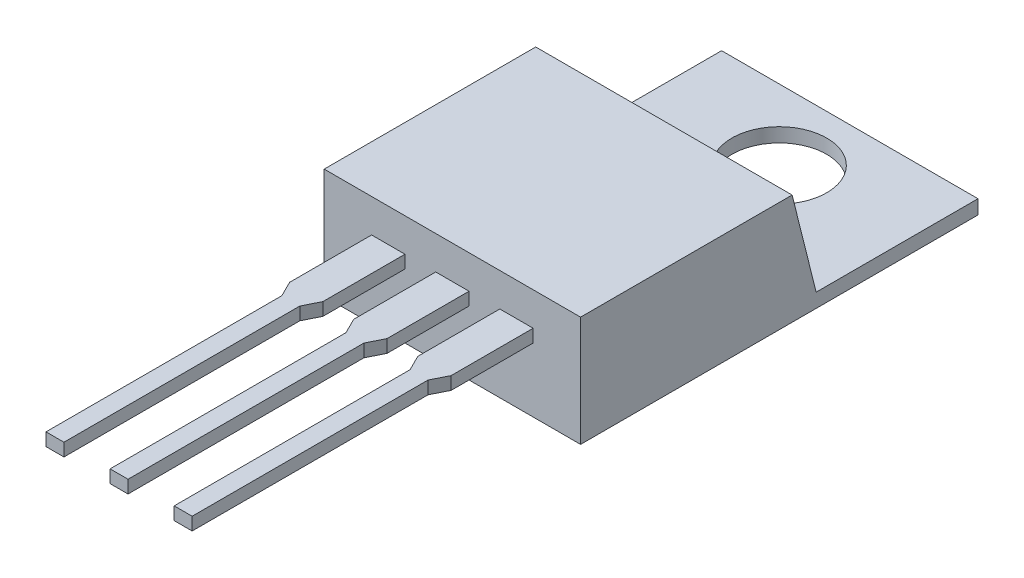
ISO-10303-21;
HEADER;
FILE_DESCRIPTION(('STEP AP214'),'2;1');
FILE_NAME('part.step','',(''),(''),'','','');
FILE_SCHEMA(('AUTOMOTIVE_DESIGN { 1 0 10303 214 1 1 1 1 }'));
ENDSEC;
DATA;
#1=APPLICATION_CONTEXT('core data for automotive mechanical design processes');
#2=APPLICATION_PROTOCOL_DEFINITION('international standard','automotive_design',2000,#1);
#3=PRODUCT_CONTEXT('',#1,'mechanical');
#4=PRODUCT('Part','Part','',(#3));
#5=PRODUCT_RELATED_PRODUCT_CATEGORY('part','',(#4));
#6=PRODUCT_DEFINITION_FORMATION('','',#4);
#7=PRODUCT_DEFINITION_CONTEXT('part definition',#1,'design');
#8=PRODUCT_DEFINITION('design','',#6,#7);
#9=PRODUCT_DEFINITION_SHAPE('','',#8);
#10=(LENGTH_UNIT() NAMED_UNIT(*) SI_UNIT(.MILLI.,.METRE.));
#11=(NAMED_UNIT(*) PLANE_ANGLE_UNIT() SI_UNIT($,.RADIAN.));
#12=(NAMED_UNIT(*) SI_UNIT($,.STERADIAN.) SOLID_ANGLE_UNIT());
#13=UNCERTAINTY_MEASURE_WITH_UNIT(LENGTH_MEASURE(1.E-05),#10,'distance_accuracy_value','');
#14=(GEOMETRIC_REPRESENTATION_CONTEXT(3) GLOBAL_UNCERTAINTY_ASSIGNED_CONTEXT((#13)) GLOBAL_UNIT_ASSIGNED_CONTEXT((#10,
#11,#12)) REPRESENTATION_CONTEXT('',''));
#15=CARTESIAN_POINT('',(0.,0.,0.));
#16=DIRECTION('',(0.,0.,1.));
#17=DIRECTION('',(1.,0.,0.));
#18=AXIS2_PLACEMENT_3D('',#15,#16,#17);
#19=CARTESIAN_POINT('',(0.,0.55,0.));
#20=DIRECTION('',(0.,0.,-1.));
#21=DIRECTION('',(-1.,0.,0.));
#22=AXIS2_PLACEMENT_3D('',#19,#20,#21);
#23=PLANE('',#22);
#24=DIRECTION('',(0.,-1.,0.));
#25=VECTOR('',#24,1.);
#26=CARTESIAN_POINT('',(4.35,3.,0.));
#27=LINE('',#26,#25);
#28=CARTESIAN_POINT('',(4.35,3.,0.));
#29=VERTEX_POINT('',#28);
#30=CARTESIAN_POINT('',(4.35,2.5,0.));
#31=VERTEX_POINT('',#30);
#32=EDGE_CURVE('E266',#29,#31,#27,.T.);
#33=ORIENTED_EDGE('',*,*,#32,.F.);
#34=DIRECTION('',(-1.,0.,0.));
#35=VECTOR('',#34,1.);
#36=CARTESIAN_POINT('',(4.35,3.,0.));
#37=LINE('',#36,#35);
#38=CARTESIAN_POINT('',(5.65,3.,0.));
#39=VERTEX_POINT('',#38);
#40=EDGE_CURVE('E394',#39,#29,#37,.T.);
#41=ORIENTED_EDGE('',*,*,#40,.F.);
#42=DIRECTION('',(0.,1.,0.));
#43=VECTOR('',#42,1.);
#44=CARTESIAN_POINT('',(5.65,3.,0.));
#45=LINE('',#44,#43);
#46=CARTESIAN_POINT('',(5.65,2.5,0.));
#47=VERTEX_POINT('',#46);
#48=EDGE_CURVE('E397',#47,#39,#45,.T.);
#49=ORIENTED_EDGE('',*,*,#48,.F.);
#50=DIRECTION('',(1.,0.,0.));
#51=VECTOR('',#50,1.);
#52=CARTESIAN_POINT('',(4.35,2.5,0.));
#53=LINE('',#52,#51);
#54=EDGE_CURVE('E401',#31,#47,#53,.T.);
#55=ORIENTED_EDGE('',*,*,#54,.F.);
#56=EDGE_LOOP('',(#33,#41,#49,#55));
#57=FACE_BOUND('',#56,.T.);
#58=DIRECTION('',(1.,0.,0.));
#59=VECTOR('',#58,1.);
#60=CARTESIAN_POINT('',(0.,0.,0.));
#61=LINE('',#60,#59);
#62=CARTESIAN_POINT('',(0.,0.,0.));
#63=VERTEX_POINT('',#62);
#64=CARTESIAN_POINT('',(10.,0.,0.));
#65=VERTEX_POINT('',#64);
#66=EDGE_CURVE('E304',#63,#65,#61,.T.);
#67=ORIENTED_EDGE('',*,*,#66,.T.);
#68=DIRECTION('',(0.,-1.,0.));
#69=VECTOR('',#68,1.);
#70=CARTESIAN_POINT('',(10.,0.55,0.));
#71=LINE('',#70,#69);
#72=CARTESIAN_POINT('',(10.,4.3,0.));
#73=VERTEX_POINT('',#72);
#74=EDGE_CURVE('E314',#73,#65,#71,.T.);
#75=ORIENTED_EDGE('',*,*,#74,.F.);
#76=DIRECTION('',(1.,0.,0.));
#77=VECTOR('',#76,1.);
#78=CARTESIAN_POINT('',(0.,4.3,0.));
#79=LINE('',#78,#77);
#80=CARTESIAN_POINT('',(0.,4.3,0.));
#81=VERTEX_POINT('',#80);
#82=EDGE_CURVE('E281',#81,#73,#79,.T.);
#83=ORIENTED_EDGE('',*,*,#82,.F.);
#84=DIRECTION('',(0.,-1.,0.));
#85=VECTOR('',#84,1.);
#86=CARTESIAN_POINT('',(0.,0.55,0.));
#87=LINE('',#86,#85);
#88=EDGE_CURVE('E317',#81,#63,#87,.T.);
#89=ORIENTED_EDGE('',*,*,#88,.T.);
#90=EDGE_LOOP('',(#67,#75,#83,#89));
#91=FACE_BOUND('',#90,.T.);
#92=DIRECTION('',(0.,-1.,0.));
#93=VECTOR('',#92,1.);
#94=CARTESIAN_POINT('',(1.85,3.,0.));
#95=LINE('',#94,#93);
#96=CARTESIAN_POINT('',(1.85,3.,0.));
#97=VERTEX_POINT('',#96);
#98=CARTESIAN_POINT('',(1.85,2.5,0.));
#99=VERTEX_POINT('',#98);
#100=EDGE_CURVE('E262',#97,#99,#95,.T.);
#101=ORIENTED_EDGE('',*,*,#100,.F.);
#102=DIRECTION('',(-1.,0.,0.));
#103=VECTOR('',#102,1.);
#104=CARTESIAN_POINT('',(1.85,3.,0.));
#105=LINE('',#104,#103);
#106=CARTESIAN_POINT('',(3.15,3.,0.));
#107=VERTEX_POINT('',#106);
#108=EDGE_CURVE('E258',#107,#97,#105,.T.);
#109=ORIENTED_EDGE('',*,*,#108,.F.);
#110=DIRECTION('',(0.,1.,0.));
#111=VECTOR('',#110,1.);
#112=CARTESIAN_POINT('',(3.15,3.,0.));
#113=LINE('',#112,#111);
#114=CARTESIAN_POINT('',(3.15,2.5,0.));
#115=VERTEX_POINT('',#114);
#116=EDGE_CURVE('E269',#115,#107,#113,.T.);
#117=ORIENTED_EDGE('',*,*,#116,.F.);
#118=DIRECTION('',(1.,0.,0.));
#119=VECTOR('',#118,1.);
#120=CARTESIAN_POINT('',(1.85,2.5,0.));
#121=LINE('',#120,#119);
#122=EDGE_CURVE('E265',#99,#115,#121,.T.);
#123=ORIENTED_EDGE('',*,*,#122,.F.);
#124=EDGE_LOOP('',(#101,#109,#117,#123));
#125=FACE_BOUND('',#124,.T.);
#126=DIRECTION('',(0.,-1.,0.));
#127=VECTOR('',#126,1.);
#128=CARTESIAN_POINT('',(6.85,3.,0.));
#129=LINE('',#128,#127);
#130=CARTESIAN_POINT('',(6.85,3.,0.));
#131=VERTEX_POINT('',#130);
#132=CARTESIAN_POINT('',(6.85,2.5,0.));
#133=VERTEX_POINT('',#132);
#134=EDGE_CURVE('E378',#131,#133,#129,.T.);
#135=ORIENTED_EDGE('',*,*,#134,.F.);
#136=DIRECTION('',(-1.,0.,0.));
#137=VECTOR('',#136,1.);
#138=CARTESIAN_POINT('',(6.85,3.,0.));
#139=LINE('',#138,#137);
#140=CARTESIAN_POINT('',(8.15,3.,0.));
#141=VERTEX_POINT('',#140);
#142=EDGE_CURVE('E368',#141,#131,#139,.T.);
#143=ORIENTED_EDGE('',*,*,#142,.F.);
#144=DIRECTION('',(0.,1.,0.));
#145=VECTOR('',#144,1.);
#146=CARTESIAN_POINT('',(8.15,3.,0.));
#147=LINE('',#146,#145);
#148=CARTESIAN_POINT('',(8.15,2.5,0.));
#149=VERTEX_POINT('',#148);
#150=EDGE_CURVE('E371',#149,#141,#147,.T.);
#151=ORIENTED_EDGE('',*,*,#150,.F.);
#152=DIRECTION('',(1.,0.,0.));
#153=VECTOR('',#152,1.);
#154=CARTESIAN_POINT('',(6.85,2.5,0.));
#155=LINE('',#154,#153);
#156=EDGE_CURVE('E375',#133,#149,#155,.T.);
#157=ORIENTED_EDGE('',*,*,#156,.F.);
#158=EDGE_LOOP('',(#135,#143,#151,#157));
#159=FACE_BOUND('',#158,.T.);
#160=ADVANCED_FACE('F40',(#57,#91,#125,#159),#23,.F.);
#161=CARTESIAN_POINT('',(0.,0.55,0.));
#162=DIRECTION('',(0.,-1.,0.));
#163=DIRECTION('',(0.,0.,-1.));
#164=AXIS2_PLACEMENT_3D('',#161,#162,#163);
#165=PLANE('',#164);
#166=CARTESIAN_POINT('',(5.,0.55,-12.75));
#167=DIRECTION('',(0.,1.,0.));
#168=DIRECTION('',(0.,0.,1.));
#169=AXIS2_PLACEMENT_3D('',#166,#167,#168);
#170=CIRCLE('',#169,1.85);
#171=CARTESIAN_POINT('',(5.,0.55,-10.9));
#172=VERTEX_POINT('',#171);
#173=EDGE_CURVE('E288',#172,#172,#170,.T.);
#174=ORIENTED_EDGE('',*,*,#173,.F.);
#175=EDGE_LOOP('',(#174));
#176=FACE_BOUND('',#175,.T.);
#177=DIRECTION('',(0.,0.,1.));
#178=VECTOR('',#177,1.);
#179=CARTESIAN_POINT('',(0.,0.55,0.));
#180=LINE('',#179,#178);
#181=CARTESIAN_POINT('',(0.,0.55,-15.5));
#182=VERTEX_POINT('',#181);
#183=CARTESIAN_POINT('',(0.,0.55,-9.1875));
#184=VERTEX_POINT('',#183);
#185=EDGE_CURVE('E294',#182,#184,#180,.T.);
#186=ORIENTED_EDGE('',*,*,#185,.T.);
#187=DIRECTION('',(-1.,0.,0.));
#188=VECTOR('',#187,1.);
#189=CARTESIAN_POINT('',(0.,0.55,-9.1875));
#190=LINE('',#189,#188);
#191=CARTESIAN_POINT('',(10.,0.55,-9.1875));
#192=VERTEX_POINT('',#191);
#193=EDGE_CURVE('E328',#184,#192,#190,.F.);
#194=ORIENTED_EDGE('',*,*,#193,.T.);
#195=DIRECTION('',(0.,0.,-1.));
#196=VECTOR('',#195,1.);
#197=CARTESIAN_POINT('',(10.,0.55,0.));
#198=LINE('',#197,#196);
#199=CARTESIAN_POINT('',(10.,0.55,-15.5));
#200=VERTEX_POINT('',#199);
#201=EDGE_CURVE('E296',#192,#200,#198,.T.);
#202=ORIENTED_EDGE('',*,*,#201,.T.);
#203=DIRECTION('',(-1.,0.,0.));
#204=VECTOR('',#203,1.);
#205=CARTESIAN_POINT('',(0.,0.55,-15.5));
#206=LINE('',#205,#204);
#207=EDGE_CURVE('E299',#200,#182,#206,.T.);
#208=ORIENTED_EDGE('',*,*,#207,.T.);
#209=EDGE_LOOP('',(#186,#194,#202,#208));
#210=FACE_BOUND('',#209,.T.);
#211=ADVANCED_FACE('F518',(#176,#210),#165,.F.);
#212=CARTESIAN_POINT('',(0.,0.,0.));
#213=DIRECTION('',(0.,-1.,0.));
#214=DIRECTION('',(0.,0.,-1.));
#215=AXIS2_PLACEMENT_3D('',#212,#213,#214);
#216=PLANE('',#215);
#217=DIRECTION('',(0.,0.,1.));
#218=VECTOR('',#217,1.);
#219=CARTESIAN_POINT('',(0.,0.,0.));
#220=LINE('',#219,#218);
#221=CARTESIAN_POINT('',(0.,0.,-15.5));
#222=VERTEX_POINT('',#221);
#223=EDGE_CURVE('E291',#222,#63,#220,.T.);
#224=ORIENTED_EDGE('',*,*,#223,.F.);
#225=DIRECTION('',(-1.,0.,0.));
#226=VECTOR('',#225,1.);
#227=CARTESIAN_POINT('',(0.,0.,-15.5));
#228=LINE('',#227,#226);
#229=CARTESIAN_POINT('',(10.,0.,-15.5));
#230=VERTEX_POINT('',#229);
#231=EDGE_CURVE('E297',#230,#222,#228,.T.);
#232=ORIENTED_EDGE('',*,*,#231,.F.);
#233=DIRECTION('',(0.,0.,-1.));
#234=VECTOR('',#233,1.);
#235=CARTESIAN_POINT('',(10.,0.,0.));
#236=LINE('',#235,#234);
#237=EDGE_CURVE('E306',#65,#230,#236,.T.);
#238=ORIENTED_EDGE('',*,*,#237,.F.);
#239=ORIENTED_EDGE('',*,*,#66,.F.);
#240=EDGE_LOOP('',(#224,#232,#238,#239));
#241=FACE_BOUND('',#240,.T.);
#242=CARTESIAN_POINT('',(5.,0.,-12.75));
#243=DIRECTION('',(0.,1.,0.));
#244=DIRECTION('',(0.,0.,1.));
#245=AXIS2_PLACEMENT_3D('',#242,#243,#244);
#246=CIRCLE('',#245,1.85);
#247=CARTESIAN_POINT('',(5.,0.,-10.9));
#248=VERTEX_POINT('',#247);
#249=EDGE_CURVE('E287',#248,#248,#246,.T.);
#250=ORIENTED_EDGE('',*,*,#249,.T.);
#251=EDGE_LOOP('',(#250));
#252=FACE_BOUND('',#251,.T.);
#253=ADVANCED_FACE('F524',(#241,#252),#216,.T.);
#254=CARTESIAN_POINT('',(0.,0.55,0.));
#255=DIRECTION('',(1.,0.,0.));
#256=DIRECTION('',(0.,0.,-1.));
#257=AXIS2_PLACEMENT_3D('',#254,#255,#256);
#258=PLANE('',#257);
#259=DIRECTION('',(0.,0.97014250014533,0.242535625036339));
#260=VECTOR('',#259,1.);
#261=CARTESIAN_POINT('',(0.,4.3,-8.24999999999997));
#262=LINE('',#261,#260);
#263=CARTESIAN_POINT('',(0.,4.3,-8.24999999999997));
#264=VERTEX_POINT('',#263);
#265=EDGE_CURVE('E323',#264,#184,#262,.F.);
#266=ORIENTED_EDGE('',*,*,#265,.T.);
#267=ORIENTED_EDGE('',*,*,#185,.F.);
#268=DIRECTION('',(0.,-1.,0.));
#269=VECTOR('',#268,1.);
#270=CARTESIAN_POINT('',(0.,0.55,-15.5));
#271=LINE('',#270,#269);
#272=EDGE_CURVE('E301',#182,#222,#271,.T.);
#273=ORIENTED_EDGE('',*,*,#272,.T.);
#274=ORIENTED_EDGE('',*,*,#223,.T.);
#275=ORIENTED_EDGE('',*,*,#88,.F.);
#276=DIRECTION('',(0.,0.,1.));
#277=VECTOR('',#276,1.);
#278=CARTESIAN_POINT('',(0.,4.3,0.));
#279=LINE('',#278,#277);
#280=EDGE_CURVE('E279',#264,#81,#279,.T.);
#281=ORIENTED_EDGE('',*,*,#280,.F.);
#282=EDGE_LOOP('',(#266,#267,#273,#274,#275,#281));
#283=FACE_BOUND('',#282,.T.);
#284=ADVANCED_FACE('F532',(#283),#258,.F.);
#285=CARTESIAN_POINT('',(10.,0.55,0.));
#286=DIRECTION('',(-1.,0.,0.));
#287=DIRECTION('',(0.,0.,1.));
#288=AXIS2_PLACEMENT_3D('',#285,#286,#287);
#289=PLANE('',#288);
#290=ORIENTED_EDGE('',*,*,#201,.F.);
#291=DIRECTION('',(0.,-0.97014250014533,-0.242535625036339));
#292=VECTOR('',#291,1.);
#293=CARTESIAN_POINT('',(10.,4.3,-8.24999999999997));
#294=LINE('',#293,#292);
#295=CARTESIAN_POINT('',(10.,4.3,-8.24999999999997));
#296=VERTEX_POINT('',#295);
#297=EDGE_CURVE('E326',#192,#296,#294,.F.);
#298=ORIENTED_EDGE('',*,*,#297,.T.);
#299=DIRECTION('',(0.,0.,-1.));
#300=VECTOR('',#299,1.);
#301=CARTESIAN_POINT('',(10.,4.3,0.));
#302=LINE('',#301,#300);
#303=EDGE_CURVE('E284',#73,#296,#302,.T.);
#304=ORIENTED_EDGE('',*,*,#303,.F.);
#305=ORIENTED_EDGE('',*,*,#74,.T.);
#306=ORIENTED_EDGE('',*,*,#237,.T.);
#307=DIRECTION('',(0.,-1.,0.));
#308=VECTOR('',#307,1.);
#309=CARTESIAN_POINT('',(10.,0.55,-15.5));
#310=LINE('',#309,#308);
#311=EDGE_CURVE('E311',#200,#230,#310,.T.);
#312=ORIENTED_EDGE('',*,*,#311,.F.);
#313=EDGE_LOOP('',(#290,#298,#304,#305,#306,#312));
#314=FACE_BOUND('',#313,.T.);
#315=ADVANCED_FACE('F530',(#314),#289,.F.);
#316=CARTESIAN_POINT('',(0.,0.55,-15.5));
#317=DIRECTION('',(0.,0.,1.));
#318=DIRECTION('',(1.,0.,0.));
#319=AXIS2_PLACEMENT_3D('',#316,#317,#318);
#320=PLANE('',#319);
#321=ORIENTED_EDGE('',*,*,#231,.T.);
#322=ORIENTED_EDGE('',*,*,#272,.F.);
#323=ORIENTED_EDGE('',*,*,#207,.F.);
#324=ORIENTED_EDGE('',*,*,#311,.T.);
#325=EDGE_LOOP('',(#321,#322,#323,#324));
#326=FACE_BOUND('',#325,.T.);
#327=ADVANCED_FACE('F539',(#326),#320,.F.);
#328=CARTESIAN_POINT('',(5.,0.55,-12.75));
#329=DIRECTION('',(0.,-1.,0.));
#330=DIRECTION('',(0.,0.,-1.));
#331=AXIS2_PLACEMENT_3D('',#328,#329,#330);
#332=CYLINDRICAL_SURFACE('',#331,1.85);
#333=ORIENTED_EDGE('',*,*,#173,.T.);
#334=EDGE_LOOP('',(#333));
#335=FACE_BOUND('',#334,.T.);
#336=ORIENTED_EDGE('',*,*,#249,.F.);
#337=EDGE_LOOP('',(#336));
#338=FACE_BOUND('',#337,.T.);
#339=ADVANCED_FACE('F564',(#335,#338),#332,.F.);
#340=CARTESIAN_POINT('',(0.,4.3,0.));
#341=DIRECTION('',(0.,-1.,0.));
#342=DIRECTION('',(0.,0.,-1.));
#343=AXIS2_PLACEMENT_3D('',#340,#341,#342);
#344=PLANE('',#343);
#345=ORIENTED_EDGE('',*,*,#303,.T.);
#346=DIRECTION('',(-1.,0.,0.));
#347=VECTOR('',#346,1.);
#348=CARTESIAN_POINT('',(0.,4.3,-8.24999999999997));
#349=LINE('',#348,#347);
#350=EDGE_CURVE('E320',#296,#264,#349,.T.);
#351=ORIENTED_EDGE('',*,*,#350,.T.);
#352=ORIENTED_EDGE('',*,*,#280,.T.);
#353=ORIENTED_EDGE('',*,*,#82,.T.);
#354=EDGE_LOOP('',(#345,#351,#352,#353));
#355=FACE_BOUND('',#354,.T.);
#356=ADVANCED_FACE('F562',(#355),#344,.F.);
#357=CARTESIAN_POINT('',(0.,4.3,-8.24999999999997));
#358=DIRECTION('',(0.,-0.242535625036339,0.97014250014533));
#359=DIRECTION('',(-1.,0.,0.));
#360=AXIS2_PLACEMENT_3D('',#357,#358,#359);
#361=PLANE('',#360);
#362=ORIENTED_EDGE('',*,*,#297,.F.);
#363=ORIENTED_EDGE('',*,*,#193,.F.);
#364=ORIENTED_EDGE('',*,*,#265,.F.);
#365=ORIENTED_EDGE('',*,*,#350,.F.);
#366=EDGE_LOOP('',(#362,#363,#364,#365));
#367=FACE_BOUND('',#366,.T.);
#368=ADVANCED_FACE('F43',(#367),#361,.F.);
#369=CARTESIAN_POINT('',(1.85,3.,13.));
#370=DIRECTION('',(1.,0.,0.));
#371=DIRECTION('',(0.,1.,0.));
#372=AXIS2_PLACEMENT_3D('',#369,#370,#371);
#373=PLANE('',#372);
#374=DIRECTION('',(0.,0.,-1.));
#375=VECTOR('',#374,1.);
#376=CARTESIAN_POINT('',(1.85,2.5,13.));
#377=LINE('',#376,#375);
#378=CARTESIAN_POINT('',(1.85,2.5,3.2));
#379=VERTEX_POINT('',#378);
#380=EDGE_CURVE('E277',#379,#99,#377,.T.);
#381=ORIENTED_EDGE('',*,*,#380,.F.);
#382=DIRECTION('',(0.,1.,0.));
#383=VECTOR('',#382,1.);
#384=CARTESIAN_POINT('',(1.85,0.,3.2));
#385=LINE('',#384,#383);
#386=CARTESIAN_POINT('',(1.85,3.,3.2));
#387=VERTEX_POINT('',#386);
#388=EDGE_CURVE('E439',#379,#387,#385,.T.);
#389=ORIENTED_EDGE('',*,*,#388,.T.);
#390=DIRECTION('',(0.,0.,-1.));
#391=VECTOR('',#390,1.);
#392=CARTESIAN_POINT('',(1.85,3.,13.));
#393=LINE('',#392,#391);
#394=EDGE_CURVE('E253',#387,#97,#393,.T.);
#395=ORIENTED_EDGE('',*,*,#394,.T.);
#396=ORIENTED_EDGE('',*,*,#100,.T.);
#397=EDGE_LOOP('',(#381,#389,#395,#396));
#398=FACE_BOUND('',#397,.T.);
#399=ADVANCED_FACE('F493',(#398),#373,.F.);
#400=CARTESIAN_POINT('',(1.85,2.5,13.));
#401=DIRECTION('',(0.,1.,0.));
#402=DIRECTION('',(0.,0.,1.));
#403=AXIS2_PLACEMENT_3D('',#400,#401,#402);
#404=PLANE('',#403);
#405=DIRECTION('',(0.,0.,-1.));
#406=VECTOR('',#405,1.);
#407=CARTESIAN_POINT('',(2.15,2.5,13.));
#408=LINE('',#407,#406);
#409=CARTESIAN_POINT('',(2.15,2.5,13.));
#410=VERTEX_POINT('',#409);
#411=CARTESIAN_POINT('',(2.15,2.5,3.8));
#412=VERTEX_POINT('',#411);
#413=EDGE_CURVE('E63',#410,#412,#408,.T.);
#414=ORIENTED_EDGE('',*,*,#413,.T.);
#415=DIRECTION('',(-0.447213595499958,0.,-0.894427190999916));
#416=VECTOR('',#415,1.);
#417=CARTESIAN_POINT('',(5.77,2.5,11.04));
#418=LINE('',#417,#416);
#419=EDGE_CURVE('E356',#412,#379,#418,.T.);
#420=ORIENTED_EDGE('',*,*,#419,.T.);
#421=ORIENTED_EDGE('',*,*,#380,.T.);
#422=ORIENTED_EDGE('',*,*,#122,.T.);
#423=DIRECTION('',(0.,0.,-1.));
#424=VECTOR('',#423,1.);
#425=CARTESIAN_POINT('',(3.15,2.5,13.));
#426=LINE('',#425,#424);
#427=CARTESIAN_POINT('',(3.15,2.5,3.2));
#428=VERTEX_POINT('',#427);
#429=EDGE_CURVE('E275',#428,#115,#426,.T.);
#430=ORIENTED_EDGE('',*,*,#429,.F.);
#431=DIRECTION('',(-0.447213595499958,0.,0.894427190999916));
#432=VECTOR('',#431,1.);
#433=CARTESIAN_POINT('',(-1.03,2.5,11.56));
#434=LINE('',#433,#432);
#435=CARTESIAN_POINT('',(2.85,2.5,3.8));
#436=VERTEX_POINT('',#435);
#437=EDGE_CURVE('E346',#428,#436,#434,.T.);
#438=ORIENTED_EDGE('',*,*,#437,.T.);
#439=DIRECTION('',(0.,0.,1.));
#440=VECTOR('',#439,1.);
#441=CARTESIAN_POINT('',(2.85,2.5,13.));
#442=LINE('',#441,#440);
#443=CARTESIAN_POINT('',(2.85,2.5,13.));
#444=VERTEX_POINT('',#443);
#445=EDGE_CURVE('E340',#436,#444,#442,.T.);
#446=ORIENTED_EDGE('',*,*,#445,.T.);
#447=DIRECTION('',(1.,0.,0.));
#448=VECTOR('',#447,1.);
#449=CARTESIAN_POINT('',(1.85,2.5,13.));
#450=LINE('',#449,#448);
#451=EDGE_CURVE('E254',#410,#444,#450,.T.);
#452=ORIENTED_EDGE('',*,*,#451,.F.);
#453=EDGE_LOOP('',(#414,#420,#421,#422,#430,#438,#446,#452));
#454=FACE_BOUND('',#453,.T.);
#455=ADVANCED_FACE('F344',(#454),#404,.F.);
#456=CARTESIAN_POINT('',(3.15,3.,13.));
#457=DIRECTION('',(-1.,0.,0.));
#458=DIRECTION('',(0.,0.,1.));
#459=AXIS2_PLACEMENT_3D('',#456,#457,#458);
#460=PLANE('',#459);
#461=DIRECTION('',(0.,0.,-1.));
#462=VECTOR('',#461,1.);
#463=CARTESIAN_POINT('',(3.15,3.,13.));
#464=LINE('',#463,#462);
#465=CARTESIAN_POINT('',(3.15,3.,3.2));
#466=VERTEX_POINT('',#465);
#467=EDGE_CURVE('E256',#466,#107,#464,.T.);
#468=ORIENTED_EDGE('',*,*,#467,.F.);
#469=DIRECTION('',(0.,1.,0.));
#470=VECTOR('',#469,1.);
#471=CARTESIAN_POINT('',(3.15,0.,3.2));
#472=LINE('',#471,#470);
#473=EDGE_CURVE('E475',#428,#466,#472,.T.);
#474=ORIENTED_EDGE('',*,*,#473,.F.);
#475=ORIENTED_EDGE('',*,*,#429,.T.);
#476=ORIENTED_EDGE('',*,*,#116,.T.);
#477=EDGE_LOOP('',(#468,#474,#475,#476));
#478=FACE_BOUND('',#477,.T.);
#479=ADVANCED_FACE('F503',(#478),#460,.F.);
#480=CARTESIAN_POINT('',(1.85,3.,13.));
#481=DIRECTION('',(0.,-1.,0.));
#482=DIRECTION('',(0.,0.,-1.));
#483=AXIS2_PLACEMENT_3D('',#480,#481,#482);
#484=PLANE('',#483);
#485=ORIENTED_EDGE('',*,*,#394,.F.);
#486=DIRECTION('',(-0.447213595499958,0.,-0.894427190999916));
#487=VECTOR('',#486,1.);
#488=CARTESIAN_POINT('',(1.85,3.,3.2));
#489=LINE('',#488,#487);
#490=CARTESIAN_POINT('',(2.15,3.,3.8));
#491=VERTEX_POINT('',#490);
#492=EDGE_CURVE('E249',#491,#387,#489,.T.);
#493=ORIENTED_EDGE('',*,*,#492,.F.);
#494=DIRECTION('',(0.,0.,-1.));
#495=VECTOR('',#494,1.);
#496=CARTESIAN_POINT('',(2.15,3.,3.8));
#497=LINE('',#496,#495);
#498=CARTESIAN_POINT('',(2.15,3.,13.));
#499=VERTEX_POINT('',#498);
#500=EDGE_CURVE('E238',#499,#491,#497,.T.);
#501=ORIENTED_EDGE('',*,*,#500,.F.);
#502=DIRECTION('',(-1.,0.,0.));
#503=VECTOR('',#502,1.);
#504=CARTESIAN_POINT('',(1.85,3.,13.));
#505=LINE('',#504,#503);
#506=CARTESIAN_POINT('',(2.85,3.,13.));
#507=VERTEX_POINT('',#506);
#508=EDGE_CURVE('E248',#507,#499,#505,.T.);
#509=ORIENTED_EDGE('',*,*,#508,.F.);
#510=DIRECTION('',(0.,0.,1.));
#511=VECTOR('',#510,1.);
#512=CARTESIAN_POINT('',(2.85,3.,3.8));
#513=LINE('',#512,#511);
#514=CARTESIAN_POINT('',(2.85,3.,3.8));
#515=VERTEX_POINT('',#514);
#516=EDGE_CURVE('E56',#515,#507,#513,.T.);
#517=ORIENTED_EDGE('',*,*,#516,.F.);
#518=DIRECTION('',(-0.447213595499958,0.,0.894427190999916));
#519=VECTOR('',#518,1.);
#520=CARTESIAN_POINT('',(3.15,3.,3.2));
#521=LINE('',#520,#519);
#522=EDGE_CURVE('E470',#466,#515,#521,.T.);
#523=ORIENTED_EDGE('',*,*,#522,.F.);
#524=ORIENTED_EDGE('',*,*,#467,.T.);
#525=ORIENTED_EDGE('',*,*,#108,.T.);
#526=EDGE_LOOP('',(#485,#493,#501,#509,#517,#523,#524,#525));
#527=FACE_BOUND('',#526,.T.);
#528=ADVANCED_FACE('F247',(#527),#484,.F.);
#529=CARTESIAN_POINT('',(0.,0.,13.));
#530=DIRECTION('',(0.,0.,1.));
#531=DIRECTION('',(1.,0.,0.));
#532=AXIS2_PLACEMENT_3D('',#529,#530,#531);
#533=PLANE('',#532);
#534=DIRECTION('',(0.,1.,0.));
#535=VECTOR('',#534,1.);
#536=CARTESIAN_POINT('',(2.15,0.,13.));
#537=LINE('',#536,#535);
#538=EDGE_CURVE('E11',#410,#499,#537,.T.);
#539=ORIENTED_EDGE('',*,*,#538,.F.);
#540=ORIENTED_EDGE('',*,*,#451,.T.);
#541=DIRECTION('',(0.,-1.,0.));
#542=VECTOR('',#541,1.);
#543=CARTESIAN_POINT('',(2.85,0.,13.));
#544=LINE('',#543,#542);
#545=EDGE_CURVE('E49',#507,#444,#544,.T.);
#546=ORIENTED_EDGE('',*,*,#545,.F.);
#547=ORIENTED_EDGE('',*,*,#508,.T.);
#548=EDGE_LOOP('',(#539,#540,#546,#547));
#549=FACE_BOUND('',#548,.T.);
#550=ADVANCED_FACE('F252',(#549),#533,.T.);
#551=CARTESIAN_POINT('',(4.35,3.,13.));
#552=DIRECTION('',(1.,0.,0.));
#553=DIRECTION('',(0.,0.,-1.));
#554=AXIS2_PLACEMENT_3D('',#551,#552,#553);
#555=PLANE('',#554);
#556=DIRECTION('',(0.,0.,-1.));
#557=VECTOR('',#556,1.);
#558=CARTESIAN_POINT('',(4.35,2.5,13.));
#559=LINE('',#558,#557);
#560=CARTESIAN_POINT('',(4.35,2.5,3.2));
#561=VERTEX_POINT('',#560);
#562=EDGE_CURVE('E381',#561,#31,#559,.T.);
#563=ORIENTED_EDGE('',*,*,#562,.F.);
#564=DIRECTION('',(0.,1.,0.));
#565=VECTOR('',#564,1.);
#566=CARTESIAN_POINT('',(4.35,0.,3.2));
#567=LINE('',#566,#565);
#568=CARTESIAN_POINT('',(4.35,3.,3.2));
#569=VERTEX_POINT('',#568);
#570=EDGE_CURVE('E453',#561,#569,#567,.T.);
#571=ORIENTED_EDGE('',*,*,#570,.T.);
#572=DIRECTION('',(0.,0.,-1.));
#573=VECTOR('',#572,1.);
#574=CARTESIAN_POINT('',(4.35,3.,13.));
#575=LINE('',#574,#573);
#576=EDGE_CURVE('E391',#569,#29,#575,.T.);
#577=ORIENTED_EDGE('',*,*,#576,.T.);
#578=ORIENTED_EDGE('',*,*,#32,.T.);
#579=EDGE_LOOP('',(#563,#571,#577,#578));
#580=FACE_BOUND('',#579,.T.);
#581=ADVANCED_FACE('F661',(#580),#555,.F.);
#582=CARTESIAN_POINT('',(4.35,2.5,13.));
#583=DIRECTION('',(0.,1.,0.));
#584=DIRECTION('',(0.,0.,1.));
#585=AXIS2_PLACEMENT_3D('',#582,#583,#584);
#586=PLANE('',#585);
#587=DIRECTION('',(-0.447213595499958,0.,0.894427190999916));
#588=VECTOR('',#587,1.);
#589=CARTESIAN_POINT('',(1.47,2.5,11.56));
#590=LINE('',#589,#588);
#591=CARTESIAN_POINT('',(5.65,2.5,3.2));
#592=VERTEX_POINT('',#591);
#593=CARTESIAN_POINT('',(5.35,2.5,3.8));
#594=VERTEX_POINT('',#593);
#595=EDGE_CURVE('E347',#592,#594,#590,.T.);
#596=ORIENTED_EDGE('',*,*,#595,.T.);
#597=DIRECTION('',(0.,0.,1.));
#598=VECTOR('',#597,1.);
#599=CARTESIAN_POINT('',(5.35,2.5,13.));
#600=LINE('',#599,#598);
#601=CARTESIAN_POINT('',(5.35,2.5,13.));
#602=VERTEX_POINT('',#601);
#603=EDGE_CURVE('E420',#594,#602,#600,.T.);
#604=ORIENTED_EDGE('',*,*,#603,.T.);
#605=DIRECTION('',(1.,0.,0.));
#606=VECTOR('',#605,1.);
#607=CARTESIAN_POINT('',(4.35,2.5,13.));
#608=LINE('',#607,#606);
#609=CARTESIAN_POINT('',(4.65,2.5,13.));
#610=VERTEX_POINT('',#609);
#611=EDGE_CURVE('E398',#610,#602,#608,.T.);
#612=ORIENTED_EDGE('',*,*,#611,.F.);
#613=DIRECTION('',(0.,0.,-1.));
#614=VECTOR('',#613,1.);
#615=CARTESIAN_POINT('',(4.65,2.5,13.));
#616=LINE('',#615,#614);
#617=CARTESIAN_POINT('',(4.65,2.5,3.8));
#618=VERTEX_POINT('',#617);
#619=EDGE_CURVE('E419',#610,#618,#616,.T.);
#620=ORIENTED_EDGE('',*,*,#619,.T.);
#621=DIRECTION('',(-0.447213595499955,0.,-0.894427190999917));
#622=VECTOR('',#621,1.);
#623=CARTESIAN_POINT('',(8.26999999999998,2.5,11.04));
#624=LINE('',#623,#622);
#625=EDGE_CURVE('E351',#618,#561,#624,.T.);
#626=ORIENTED_EDGE('',*,*,#625,.T.);
#627=ORIENTED_EDGE('',*,*,#562,.T.);
#628=ORIENTED_EDGE('',*,*,#54,.T.);
#629=DIRECTION('',(0.,0.,-1.));
#630=VECTOR('',#629,1.);
#631=CARTESIAN_POINT('',(5.65,2.5,13.));
#632=LINE('',#631,#630);
#633=EDGE_CURVE('E387',#592,#47,#632,.T.);
#634=ORIENTED_EDGE('',*,*,#633,.F.);
#635=EDGE_LOOP('',(#596,#604,#612,#620,#626,#627,#628,#634));
#636=FACE_BOUND('',#635,.T.);
#637=ADVANCED_FACE('F417',(#636),#586,.F.);
#638=CARTESIAN_POINT('',(5.65,3.,13.));
#639=DIRECTION('',(-1.,0.,0.));
#640=DIRECTION('',(0.,-1.,0.));
#641=AXIS2_PLACEMENT_3D('',#638,#639,#640);
#642=PLANE('',#641);
#643=DIRECTION('',(0.,0.,-1.));
#644=VECTOR('',#643,1.);
#645=CARTESIAN_POINT('',(5.65,3.,13.));
#646=LINE('',#645,#644);
#647=CARTESIAN_POINT('',(5.65,3.,3.2));
#648=VERTEX_POINT('',#647);
#649=EDGE_CURVE('E389',#648,#39,#646,.T.);
#650=ORIENTED_EDGE('',*,*,#649,.F.);
#651=DIRECTION('',(0.,1.,0.));
#652=VECTOR('',#651,1.);
#653=CARTESIAN_POINT('',(5.65,0.,3.2));
#654=LINE('',#653,#652);
#655=EDGE_CURVE('E482',#592,#648,#654,.T.);
#656=ORIENTED_EDGE('',*,*,#655,.F.);
#657=ORIENTED_EDGE('',*,*,#633,.T.);
#658=ORIENTED_EDGE('',*,*,#48,.T.);
#659=EDGE_LOOP('',(#650,#656,#657,#658));
#660=FACE_BOUND('',#659,.T.);
#661=ADVANCED_FACE('F681',(#660),#642,.F.);
#662=CARTESIAN_POINT('',(4.35,3.,13.));
#663=DIRECTION('',(0.,-1.,0.));
#664=DIRECTION('',(0.,0.,-1.));
#665=AXIS2_PLACEMENT_3D('',#662,#663,#664);
#666=PLANE('',#665);
#667=DIRECTION('',(-1.,0.,0.));
#668=VECTOR('',#667,1.);
#669=CARTESIAN_POINT('',(4.35,3.,13.));
#670=LINE('',#669,#668);
#671=CARTESIAN_POINT('',(5.35,3.,13.));
#672=VERTEX_POINT('',#671);
#673=CARTESIAN_POINT('',(4.65,3.,13.));
#674=VERTEX_POINT('',#673);
#675=EDGE_CURVE('E393',#672,#674,#670,.T.);
#676=ORIENTED_EDGE('',*,*,#675,.F.);
#677=DIRECTION('',(0.,0.,1.));
#678=VECTOR('',#677,1.);
#679=CARTESIAN_POINT('',(5.35,3.,3.8));
#680=LINE('',#679,#678);
#681=CARTESIAN_POINT('',(5.35,3.,3.8));
#682=VERTEX_POINT('',#681);
#683=EDGE_CURVE('E480',#682,#672,#680,.T.);
#684=ORIENTED_EDGE('',*,*,#683,.F.);
#685=DIRECTION('',(-0.447213595499958,0.,0.894427190999916));
#686=VECTOR('',#685,1.);
#687=CARTESIAN_POINT('',(5.65,3.,3.2));
#688=LINE('',#687,#686);
#689=EDGE_CURVE('E460',#648,#682,#688,.T.);
#690=ORIENTED_EDGE('',*,*,#689,.F.);
#691=ORIENTED_EDGE('',*,*,#649,.T.);
#692=ORIENTED_EDGE('',*,*,#40,.T.);
#693=ORIENTED_EDGE('',*,*,#576,.F.);
#694=DIRECTION('',(-0.447213595499955,0.,-0.894427190999917));
#695=VECTOR('',#694,1.);
#696=CARTESIAN_POINT('',(4.35,3.,3.2));
#697=LINE('',#696,#695);
#698=CARTESIAN_POINT('',(4.65,3.,3.8));
#699=VERTEX_POINT('',#698);
#700=EDGE_CURVE('E464',#699,#569,#697,.T.);
#701=ORIENTED_EDGE('',*,*,#700,.F.);
#702=DIRECTION('',(0.,0.,-1.));
#703=VECTOR('',#702,1.);
#704=CARTESIAN_POINT('',(4.65,3.,3.8));
#705=LINE('',#704,#703);
#706=EDGE_CURVE('E250',#674,#699,#705,.T.);
#707=ORIENTED_EDGE('',*,*,#706,.F.);
#708=EDGE_LOOP('',(#676,#684,#690,#691,#692,#693,#701,#707));
#709=FACE_BOUND('',#708,.T.);
#710=ADVANCED_FACE('F691',(#709),#666,.F.);
#711=CARTESIAN_POINT('',(0.,0.,13.));
#712=DIRECTION('',(0.,0.,1.));
#713=DIRECTION('',(1.,0.,0.));
#714=AXIS2_PLACEMENT_3D('',#711,#712,#713);
#715=PLANE('',#714);
#716=DIRECTION('',(0.,-1.,0.));
#717=VECTOR('',#716,1.);
#718=CARTESIAN_POINT('',(5.35,0.,13.));
#719=LINE('',#718,#717);
#720=EDGE_CURVE('E337',#672,#602,#719,.T.);
#721=ORIENTED_EDGE('',*,*,#720,.F.);
#722=ORIENTED_EDGE('',*,*,#675,.T.);
#723=DIRECTION('',(0.,1.,0.));
#724=VECTOR('',#723,1.);
#725=CARTESIAN_POINT('',(4.65,0.,13.));
#726=LINE('',#725,#724);
#727=EDGE_CURVE('E335',#610,#674,#726,.T.);
#728=ORIENTED_EDGE('',*,*,#727,.F.);
#729=ORIENTED_EDGE('',*,*,#611,.T.);
#730=EDGE_LOOP('',(#721,#722,#728,#729));
#731=FACE_BOUND('',#730,.T.);
#732=ADVANCED_FACE('F412',(#731),#715,.T.);
#733=CARTESIAN_POINT('',(6.85,3.,13.));
#734=DIRECTION('',(1.,0.,0.));
#735=DIRECTION('',(0.,0.,-1.));
#736=AXIS2_PLACEMENT_3D('',#733,#734,#735);
#737=PLANE('',#736);
#738=DIRECTION('',(0.,0.,-1.));
#739=VECTOR('',#738,1.);
#740=CARTESIAN_POINT('',(6.85,2.5,13.));
#741=LINE('',#740,#739);
#742=CARTESIAN_POINT('',(6.85,2.5,3.2));
#743=VERTEX_POINT('',#742);
#744=EDGE_CURVE('E359',#743,#133,#741,.T.);
#745=ORIENTED_EDGE('',*,*,#744,.F.);
#746=DIRECTION('',(0.,1.,0.));
#747=VECTOR('',#746,1.);
#748=CARTESIAN_POINT('',(6.85,0.,3.2));
#749=LINE('',#748,#747);
#750=CARTESIAN_POINT('',(6.85,3.,3.2));
#751=VERTEX_POINT('',#750);
#752=EDGE_CURVE('E457',#743,#751,#749,.T.);
#753=ORIENTED_EDGE('',*,*,#752,.T.);
#754=DIRECTION('',(0.,0.,-1.));
#755=VECTOR('',#754,1.);
#756=CARTESIAN_POINT('',(6.85,3.,13.));
#757=LINE('',#756,#755);
#758=EDGE_CURVE('E365',#751,#131,#757,.T.);
#759=ORIENTED_EDGE('',*,*,#758,.T.);
#760=ORIENTED_EDGE('',*,*,#134,.T.);
#761=EDGE_LOOP('',(#745,#753,#759,#760));
#762=FACE_BOUND('',#761,.T.);
#763=ADVANCED_FACE('F712',(#762),#737,.F.);
#764=CARTESIAN_POINT('',(6.85,2.5,13.));
#765=DIRECTION('',(0.,1.,0.));
#766=DIRECTION('',(0.,0.,1.));
#767=AXIS2_PLACEMENT_3D('',#764,#765,#766);
#768=PLANE('',#767);
#769=DIRECTION('',(0.,0.,-1.));
#770=VECTOR('',#769,1.);
#771=CARTESIAN_POINT('',(7.15,2.5,13.));
#772=LINE('',#771,#770);
#773=CARTESIAN_POINT('',(7.15,2.5,13.));
#774=VERTEX_POINT('',#773);
#775=CARTESIAN_POINT('',(7.15,2.5,3.8));
#776=VERTEX_POINT('',#775);
#777=EDGE_CURVE('E433',#774,#776,#772,.T.);
#778=ORIENTED_EDGE('',*,*,#777,.T.);
#779=DIRECTION('',(-0.447213595499957,0.,-0.894427190999916));
#780=VECTOR('',#779,1.);
#781=CARTESIAN_POINT('',(10.77,2.5,11.04));
#782=LINE('',#781,#780);
#783=EDGE_CURVE('E425',#776,#743,#782,.T.);
#784=ORIENTED_EDGE('',*,*,#783,.T.);
#785=ORIENTED_EDGE('',*,*,#744,.T.);
#786=ORIENTED_EDGE('',*,*,#156,.T.);
#787=DIRECTION('',(0.,0.,-1.));
#788=VECTOR('',#787,1.);
#789=CARTESIAN_POINT('',(8.15,2.5,13.));
#790=LINE('',#789,#788);
#791=CARTESIAN_POINT('',(8.15,2.5,3.2));
#792=VERTEX_POINT('',#791);
#793=EDGE_CURVE('E361',#792,#149,#790,.T.);
#794=ORIENTED_EDGE('',*,*,#793,.F.);
#795=DIRECTION('',(-0.44721359549996,0.,0.894427190999915));
#796=VECTOR('',#795,1.);
#797=CARTESIAN_POINT('',(3.96999999999998,2.5,11.56));
#798=LINE('',#797,#796);
#799=CARTESIAN_POINT('',(7.85,2.5,3.8));
#800=VERTEX_POINT('',#799);
#801=EDGE_CURVE('E430',#792,#800,#798,.T.);
#802=ORIENTED_EDGE('',*,*,#801,.T.);
#803=DIRECTION('',(0.,0.,1.));
#804=VECTOR('',#803,1.);
#805=CARTESIAN_POINT('',(7.85,2.5,13.));
#806=LINE('',#805,#804);
#807=CARTESIAN_POINT('',(7.85,2.5,13.));
#808=VERTEX_POINT('',#807);
#809=EDGE_CURVE('E436',#800,#808,#806,.T.);
#810=ORIENTED_EDGE('',*,*,#809,.T.);
#811=DIRECTION('',(1.,0.,0.));
#812=VECTOR('',#811,1.);
#813=CARTESIAN_POINT('',(6.85,2.5,13.));
#814=LINE('',#813,#812);
#815=EDGE_CURVE('E372',#774,#808,#814,.T.);
#816=ORIENTED_EDGE('',*,*,#815,.F.);
#817=EDGE_LOOP('',(#778,#784,#785,#786,#794,#802,#810,#816));
#818=FACE_BOUND('',#817,.T.);
#819=ADVANCED_FACE('F722',(#818),#768,.F.);
#820=CARTESIAN_POINT('',(8.15,3.,13.));
#821=DIRECTION('',(-1.,0.,0.));
#822=DIRECTION('',(0.,-1.,0.));
#823=AXIS2_PLACEMENT_3D('',#820,#821,#822);
#824=PLANE('',#823);
#825=DIRECTION('',(0.,0.,-1.));
#826=VECTOR('',#825,1.);
#827=CARTESIAN_POINT('',(8.15,3.,13.));
#828=LINE('',#827,#826);
#829=CARTESIAN_POINT('',(8.15,3.,3.2));
#830=VERTEX_POINT('',#829);
#831=EDGE_CURVE('E363',#830,#141,#828,.T.);
#832=ORIENTED_EDGE('',*,*,#831,.F.);
#833=DIRECTION('',(0.,1.,0.));
#834=VECTOR('',#833,1.);
#835=CARTESIAN_POINT('',(8.15,0.,3.2));
#836=LINE('',#835,#834);
#837=EDGE_CURVE('E446',#792,#830,#836,.T.);
#838=ORIENTED_EDGE('',*,*,#837,.F.);
#839=ORIENTED_EDGE('',*,*,#793,.T.);
#840=ORIENTED_EDGE('',*,*,#150,.T.);
#841=EDGE_LOOP('',(#832,#838,#839,#840));
#842=FACE_BOUND('',#841,.T.);
#843=ADVANCED_FACE('F733',(#842),#824,.F.);
#844=CARTESIAN_POINT('',(6.85,3.,13.));
#845=DIRECTION('',(0.,-1.,0.));
#846=DIRECTION('',(1.,0.,0.));
#847=AXIS2_PLACEMENT_3D('',#844,#845,#846);
#848=PLANE('',#847);
#849=ORIENTED_EDGE('',*,*,#758,.F.);
#850=DIRECTION('',(-0.447213595499957,0.,-0.894427190999916));
#851=VECTOR('',#850,1.);
#852=CARTESIAN_POINT('',(6.85,3.,3.2));
#853=LINE('',#852,#851);
#854=CARTESIAN_POINT('',(7.15,3.,3.8));
#855=VERTEX_POINT('',#854);
#856=EDGE_CURVE('E454',#855,#751,#853,.T.);
#857=ORIENTED_EDGE('',*,*,#856,.F.);
#858=DIRECTION('',(0.,0.,-1.));
#859=VECTOR('',#858,1.);
#860=CARTESIAN_POINT('',(7.15,3.,3.8));
#861=LINE('',#860,#859);
#862=CARTESIAN_POINT('',(7.15,3.,13.));
#863=VERTEX_POINT('',#862);
#864=EDGE_CURVE('E450',#863,#855,#861,.T.);
#865=ORIENTED_EDGE('',*,*,#864,.F.);
#866=DIRECTION('',(-1.,0.,0.));
#867=VECTOR('',#866,1.);
#868=CARTESIAN_POINT('',(6.85,3.,13.));
#869=LINE('',#868,#867);
#870=CARTESIAN_POINT('',(7.85,3.,13.));
#871=VERTEX_POINT('',#870);
#872=EDGE_CURVE('E367',#871,#863,#869,.T.);
#873=ORIENTED_EDGE('',*,*,#872,.F.);
#874=DIRECTION('',(0.,0.,1.));
#875=VECTOR('',#874,1.);
#876=CARTESIAN_POINT('',(7.85,3.,3.8));
#877=LINE('',#876,#875);
#878=CARTESIAN_POINT('',(7.85,3.,3.8));
#879=VERTEX_POINT('',#878);
#880=EDGE_CURVE('E444',#879,#871,#877,.T.);
#881=ORIENTED_EDGE('',*,*,#880,.F.);
#882=DIRECTION('',(-0.44721359549996,0.,0.894427190999915));
#883=VECTOR('',#882,1.);
#884=CARTESIAN_POINT('',(8.15,3.,3.2));
#885=LINE('',#884,#883);
#886=EDGE_CURVE('E440',#830,#879,#885,.T.);
#887=ORIENTED_EDGE('',*,*,#886,.F.);
#888=ORIENTED_EDGE('',*,*,#831,.T.);
#889=ORIENTED_EDGE('',*,*,#142,.T.);
#890=EDGE_LOOP('',(#849,#857,#865,#873,#881,#887,#888,#889));
#891=FACE_BOUND('',#890,.T.);
#892=ADVANCED_FACE('F744',(#891),#848,.F.);
#893=CARTESIAN_POINT('',(0.,0.,13.));
#894=DIRECTION('',(0.,0.,1.));
#895=DIRECTION('',(1.,0.,0.));
#896=AXIS2_PLACEMENT_3D('',#893,#894,#895);
#897=PLANE('',#896);
#898=DIRECTION('',(0.,1.,0.));
#899=VECTOR('',#898,1.);
#900=CARTESIAN_POINT('',(7.15,0.,13.));
#901=LINE('',#900,#899);
#902=EDGE_CURVE('E333',#774,#863,#901,.T.);
#903=ORIENTED_EDGE('',*,*,#902,.F.);
#904=ORIENTED_EDGE('',*,*,#815,.T.);
#905=DIRECTION('',(0.,-1.,0.));
#906=VECTOR('',#905,1.);
#907=CARTESIAN_POINT('',(7.85,0.,13.));
#908=LINE('',#907,#906);
#909=EDGE_CURVE('E331',#871,#808,#908,.T.);
#910=ORIENTED_EDGE('',*,*,#909,.F.);
#911=ORIENTED_EDGE('',*,*,#872,.T.);
#912=EDGE_LOOP('',(#903,#904,#910,#911));
#913=FACE_BOUND('',#912,.T.);
#914=ADVANCED_FACE('F755',(#913),#897,.T.);
#915=CARTESIAN_POINT('',(8.15,0.,3.2));
#916=DIRECTION('',(-0.894427190999915,0.,-0.44721359549996));
#917=DIRECTION('',(-0.44721359549996,0.,0.894427190999915));
#918=AXIS2_PLACEMENT_3D('',#915,#916,#917);
#919=PLANE('',#918);
#920=ORIENTED_EDGE('',*,*,#837,.T.);
#921=ORIENTED_EDGE('',*,*,#886,.T.);
#922=DIRECTION('',(0.,1.,0.));
#923=VECTOR('',#922,1.);
#924=CARTESIAN_POINT('',(7.85,0.,3.8));
#925=LINE('',#924,#923);
#926=EDGE_CURVE('E447',#800,#879,#925,.T.);
#927=ORIENTED_EDGE('',*,*,#926,.F.);
#928=ORIENTED_EDGE('',*,*,#801,.F.);
#929=EDGE_LOOP('',(#920,#921,#927,#928));
#930=FACE_BOUND('',#929,.T.);
#931=ADVANCED_FACE('F766',(#930),#919,.F.);
#932=CARTESIAN_POINT('',(7.85,0.,3.8));
#933=DIRECTION('',(-1.,0.,0.));
#934=DIRECTION('',(0.,0.,1.));
#935=AXIS2_PLACEMENT_3D('',#932,#933,#934);
#936=PLANE('',#935);
#937=ORIENTED_EDGE('',*,*,#926,.T.);
#938=ORIENTED_EDGE('',*,*,#880,.T.);
#939=ORIENTED_EDGE('',*,*,#909,.T.);
#940=ORIENTED_EDGE('',*,*,#809,.F.);
#941=EDGE_LOOP('',(#937,#938,#939,#940));
#942=FACE_BOUND('',#941,.T.);
#943=ADVANCED_FACE('F777',(#942),#936,.F.);
#944=CARTESIAN_POINT('',(6.85,0.,3.2));
#945=DIRECTION('',(0.894427190999916,0.,-0.447213595499957));
#946=DIRECTION('',(-0.447213595499957,0.,-0.894427190999916));
#947=AXIS2_PLACEMENT_3D('',#944,#945,#946);
#948=PLANE('',#947);
#949=DIRECTION('',(0.,1.,0.));
#950=VECTOR('',#949,1.);
#951=CARTESIAN_POINT('',(7.15,0.,3.8));
#952=LINE('',#951,#950);
#953=EDGE_CURVE('E456',#776,#855,#952,.T.);
#954=ORIENTED_EDGE('',*,*,#953,.T.);
#955=ORIENTED_EDGE('',*,*,#856,.T.);
#956=ORIENTED_EDGE('',*,*,#752,.F.);
#957=ORIENTED_EDGE('',*,*,#783,.F.);
#958=EDGE_LOOP('',(#954,#955,#956,#957));
#959=FACE_BOUND('',#958,.T.);
#960=ADVANCED_FACE('F788',(#959),#948,.F.);
#961=CARTESIAN_POINT('',(7.15,0.,3.8));
#962=DIRECTION('',(1.,0.,0.));
#963=DIRECTION('',(0.,0.,-1.));
#964=AXIS2_PLACEMENT_3D('',#961,#962,#963);
#965=PLANE('',#964);
#966=ORIENTED_EDGE('',*,*,#902,.T.);
#967=ORIENTED_EDGE('',*,*,#864,.T.);
#968=ORIENTED_EDGE('',*,*,#953,.F.);
#969=ORIENTED_EDGE('',*,*,#777,.F.);
#970=EDGE_LOOP('',(#966,#967,#968,#969));
#971=FACE_BOUND('',#970,.T.);
#972=ADVANCED_FACE('F799',(#971),#965,.F.);
#973=CARTESIAN_POINT('',(4.35,0.,3.2));
#974=DIRECTION('',(0.894427190999917,0.,-0.447213595499955));
#975=DIRECTION('',(-0.447213595499955,0.,-0.894427190999917));
#976=AXIS2_PLACEMENT_3D('',#973,#974,#975);
#977=PLANE('',#976);
#978=DIRECTION('',(0.,1.,0.));
#979=VECTOR('',#978,1.);
#980=CARTESIAN_POINT('',(4.65,0.,3.8));
#981=LINE('',#980,#979);
#982=EDGE_CURVE('E466',#618,#699,#981,.T.);
#983=ORIENTED_EDGE('',*,*,#982,.T.);
#984=ORIENTED_EDGE('',*,*,#700,.T.);
#985=ORIENTED_EDGE('',*,*,#570,.F.);
#986=ORIENTED_EDGE('',*,*,#625,.F.);
#987=EDGE_LOOP('',(#983,#984,#985,#986));
#988=FACE_BOUND('',#987,.T.);
#989=ADVANCED_FACE('F810',(#988),#977,.F.);
#990=CARTESIAN_POINT('',(4.65,0.,3.8));
#991=DIRECTION('',(1.,0.,0.));
#992=DIRECTION('',(0.,0.,-1.));
#993=AXIS2_PLACEMENT_3D('',#990,#991,#992);
#994=PLANE('',#993);
#995=ORIENTED_EDGE('',*,*,#727,.T.);
#996=ORIENTED_EDGE('',*,*,#706,.T.);
#997=ORIENTED_EDGE('',*,*,#982,.F.);
#998=ORIENTED_EDGE('',*,*,#619,.F.);
#999=EDGE_LOOP('',(#995,#996,#997,#998));
#1000=FACE_BOUND('',#999,.T.);
#1001=ADVANCED_FACE('F821',(#1000),#994,.F.);
#1002=CARTESIAN_POINT('',(5.65,0.,3.2));
#1003=DIRECTION('',(-0.894427190999916,0.,-0.447213595499958));
#1004=DIRECTION('',(-0.447213595499958,0.,0.894427190999916));
#1005=AXIS2_PLACEMENT_3D('',#1002,#1003,#1004);
#1006=PLANE('',#1005);
#1007=ORIENTED_EDGE('',*,*,#655,.T.);
#1008=ORIENTED_EDGE('',*,*,#689,.T.);
#1009=DIRECTION('',(0.,1.,0.));
#1010=VECTOR('',#1009,1.);
#1011=CARTESIAN_POINT('',(5.35,0.,3.8));
#1012=LINE('',#1011,#1010);
#1013=EDGE_CURVE('E473',#594,#682,#1012,.T.);
#1014=ORIENTED_EDGE('',*,*,#1013,.F.);
#1015=ORIENTED_EDGE('',*,*,#595,.F.);
#1016=EDGE_LOOP('',(#1007,#1008,#1014,#1015));
#1017=FACE_BOUND('',#1016,.T.);
#1018=ADVANCED_FACE('F515',(#1017),#1006,.F.);
#1019=CARTESIAN_POINT('',(5.35,0.,3.8));
#1020=DIRECTION('',(-1.,0.,0.));
#1021=DIRECTION('',(0.,0.,1.));
#1022=AXIS2_PLACEMENT_3D('',#1019,#1020,#1021);
#1023=PLANE('',#1022);
#1024=ORIENTED_EDGE('',*,*,#1013,.T.);
#1025=ORIENTED_EDGE('',*,*,#683,.T.);
#1026=ORIENTED_EDGE('',*,*,#720,.T.);
#1027=ORIENTED_EDGE('',*,*,#603,.F.);
#1028=EDGE_LOOP('',(#1024,#1025,#1026,#1027));
#1029=FACE_BOUND('',#1028,.T.);
#1030=ADVANCED_FACE('F508',(#1029),#1023,.F.);
#1031=CARTESIAN_POINT('',(3.15,0.,3.2));
#1032=DIRECTION('',(-0.894427190999916,0.,-0.447213595499958));
#1033=DIRECTION('',(-0.447213595499958,0.,0.894427190999916));
#1034=AXIS2_PLACEMENT_3D('',#1031,#1032,#1033);
#1035=PLANE('',#1034);
#1036=ORIENTED_EDGE('',*,*,#473,.T.);
#1037=ORIENTED_EDGE('',*,*,#522,.T.);
#1038=DIRECTION('',(0.,1.,0.));
#1039=VECTOR('',#1038,1.);
#1040=CARTESIAN_POINT('',(2.85,0.,3.8));
#1041=LINE('',#1040,#1039);
#1042=EDGE_CURVE('E443',#436,#515,#1041,.T.);
#1043=ORIENTED_EDGE('',*,*,#1042,.F.);
#1044=ORIENTED_EDGE('',*,*,#437,.F.);
#1045=EDGE_LOOP('',(#1036,#1037,#1043,#1044));
#1046=FACE_BOUND('',#1045,.T.);
#1047=ADVANCED_FACE('F506',(#1046),#1035,.F.);
#1048=CARTESIAN_POINT('',(2.85,0.,3.8));
#1049=DIRECTION('',(-1.,0.,0.));
#1050=DIRECTION('',(0.,0.,1.));
#1051=AXIS2_PLACEMENT_3D('',#1048,#1049,#1050);
#1052=PLANE('',#1051);
#1053=ORIENTED_EDGE('',*,*,#1042,.T.);
#1054=ORIENTED_EDGE('',*,*,#516,.T.);
#1055=ORIENTED_EDGE('',*,*,#545,.T.);
#1056=ORIENTED_EDGE('',*,*,#445,.F.);
#1057=EDGE_LOOP('',(#1053,#1054,#1055,#1056));
#1058=FACE_BOUND('',#1057,.T.);
#1059=ADVANCED_FACE('F339',(#1058),#1052,.F.);
#1060=CARTESIAN_POINT('',(1.85,0.,3.2));
#1061=DIRECTION('',(0.894427190999916,0.,-0.447213595499958));
#1062=DIRECTION('',(-0.447213595499958,0.,-0.894427190999916));
#1063=AXIS2_PLACEMENT_3D('',#1060,#1061,#1062);
#1064=PLANE('',#1063);
#1065=DIRECTION('',(0.,1.,0.));
#1066=VECTOR('',#1065,1.);
#1067=CARTESIAN_POINT('',(2.15,0.,3.8));
#1068=LINE('',#1067,#1066);
#1069=EDGE_CURVE('E485',#412,#491,#1068,.T.);
#1070=ORIENTED_EDGE('',*,*,#1069,.T.);
#1071=ORIENTED_EDGE('',*,*,#492,.T.);
#1072=ORIENTED_EDGE('',*,*,#388,.F.);
#1073=ORIENTED_EDGE('',*,*,#419,.F.);
#1074=EDGE_LOOP('',(#1070,#1071,#1072,#1073));
#1075=FACE_BOUND('',#1074,.T.);
#1076=ADVANCED_FACE('F490',(#1075),#1064,.F.);
#1077=CARTESIAN_POINT('',(2.15,0.,3.8));
#1078=DIRECTION('',(1.,0.,0.));
#1079=DIRECTION('',(0.,0.,-1.));
#1080=AXIS2_PLACEMENT_3D('',#1077,#1078,#1079);
#1081=PLANE('',#1080);
#1082=ORIENTED_EDGE('',*,*,#538,.T.);
#1083=ORIENTED_EDGE('',*,*,#500,.T.);
#1084=ORIENTED_EDGE('',*,*,#1069,.F.);
#1085=ORIENTED_EDGE('',*,*,#413,.F.);
#1086=EDGE_LOOP('',(#1082,#1083,#1084,#1085));
#1087=FACE_BOUND('',#1086,.T.);
#1088=ADVANCED_FACE('F237',(#1087),#1081,.F.);
#1089=CLOSED_SHELL('',(#160,#211,#253,#284,#315,#327,#339,#356,#368,#399,#455,#479,#528,#550,
#581,#637,#661,#710,#732,#763,#819,#843,#892,#914,#931,#943,#960,#972,#989,#1001,#1018,#1030,
#1047,#1059,#1076,#1088));
#1090=MANIFOLD_SOLID_BREP('B2',#1089);
#1091=ADVANCED_BREP_SHAPE_REPRESENTATION('',(#18,#1090),#14);
#1092=SHAPE_DEFINITION_REPRESENTATION(#9,#1091);
ENDSEC;
END-ISO-10303-21;
